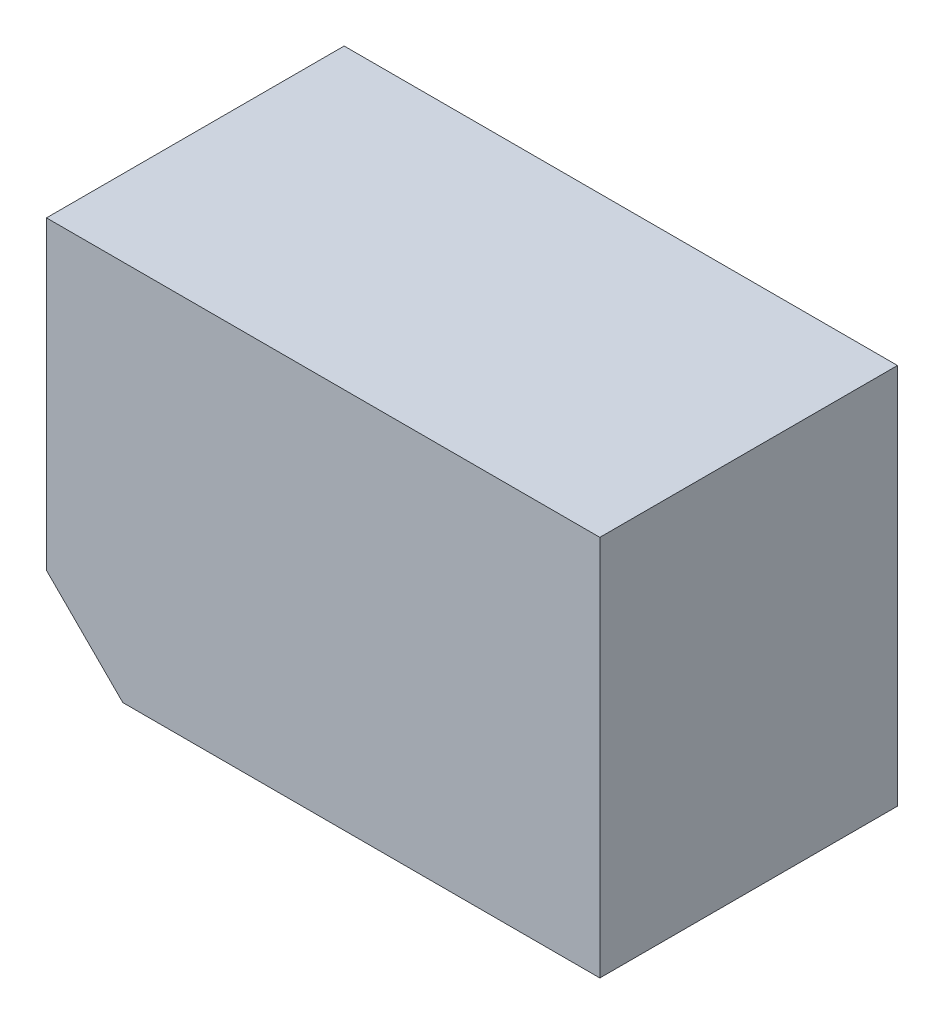
ISO-10303-21;
HEADER;
FILE_DESCRIPTION(('STEP AP214'),'2;1');
FILE_NAME('part.step','',(''),(''),'','','');
FILE_SCHEMA(('AUTOMOTIVE_DESIGN { 1 0 10303 214 1 1 1 1 }'));
ENDSEC;
DATA;
#1=APPLICATION_CONTEXT('core data for automotive mechanical design processes');
#2=APPLICATION_PROTOCOL_DEFINITION('international standard','automotive_design',2000,#1);
#3=PRODUCT_CONTEXT('',#1,'mechanical');
#4=PRODUCT('Part','Part','',(#3));
#5=PRODUCT_RELATED_PRODUCT_CATEGORY('part','',(#4));
#6=PRODUCT_DEFINITION_FORMATION('','',#4);
#7=PRODUCT_DEFINITION_CONTEXT('part definition',#1,'design');
#8=PRODUCT_DEFINITION('design','',#6,#7);
#9=PRODUCT_DEFINITION_SHAPE('','',#8);
#10=(LENGTH_UNIT() NAMED_UNIT(*) SI_UNIT(.MILLI.,.METRE.));
#11=(NAMED_UNIT(*) PLANE_ANGLE_UNIT() SI_UNIT($,.RADIAN.));
#12=(NAMED_UNIT(*) SI_UNIT($,.STERADIAN.) SOLID_ANGLE_UNIT());
#13=UNCERTAINTY_MEASURE_WITH_UNIT(LENGTH_MEASURE(1.E-05),#10,'distance_accuracy_value','');
#14=(GEOMETRIC_REPRESENTATION_CONTEXT(3) GLOBAL_UNCERTAINTY_ASSIGNED_CONTEXT((#13)) GLOBAL_UNIT_ASSIGNED_CONTEXT((#10,
#11,#12)) REPRESENTATION_CONTEXT('',''));
#15=CARTESIAN_POINT('',(0.,0.,0.));
#16=DIRECTION('',(0.,0.,1.));
#17=DIRECTION('',(1.,0.,0.));
#18=AXIS2_PLACEMENT_3D('',#15,#16,#17);
#19=CARTESIAN_POINT('',(0.,0.,78.));
#20=DIRECTION('',(-1.,0.,0.));
#21=DIRECTION('',(0.,0.,1.));
#22=AXIS2_PLACEMENT_3D('',#19,#20,#21);
#23=PLANE('',#22);
#24=DIRECTION('',(0.,1.,0.));
#25=VECTOR('',#24,1.);
#26=CARTESIAN_POINT('',(0.,0.,0.));
#27=LINE('',#26,#25);
#28=CARTESIAN_POINT('',(0.,-100.,0.));
#29=VERTEX_POINT('',#28);
#30=CARTESIAN_POINT('',(0.,0.,0.));
#31=VERTEX_POINT('',#30);
#32=EDGE_CURVE('E106',#29,#31,#27,.T.);
#33=ORIENTED_EDGE('',*,*,#32,.T.);
#34=DIRECTION('',(0.,0.,-1.));
#35=VECTOR('',#34,1.);
#36=CARTESIAN_POINT('',(0.,0.,78.));
#37=LINE('',#36,#35);
#38=CARTESIAN_POINT('',(0.,0.,78.));
#39=VERTEX_POINT('',#38);
#40=EDGE_CURVE('E11',#39,#31,#37,.T.);
#41=ORIENTED_EDGE('',*,*,#40,.F.);
#42=DIRECTION('',(0.,1.,0.));
#43=VECTOR('',#42,1.);
#44=CARTESIAN_POINT('',(0.,0.,78.));
#45=LINE('',#44,#43);
#46=CARTESIAN_POINT('',(0.,-100.,78.));
#47=VERTEX_POINT('',#46);
#48=EDGE_CURVE('E114',#47,#39,#45,.T.);
#49=ORIENTED_EDGE('',*,*,#48,.F.);
#50=DIRECTION('',(0.,0.,-1.));
#51=VECTOR('',#50,1.);
#52=CARTESIAN_POINT('',(0.,-100.,78.));
#53=LINE('',#52,#51);
#54=EDGE_CURVE('E102',#47,#29,#53,.T.);
#55=ORIENTED_EDGE('',*,*,#54,.T.);
#56=EDGE_LOOP('',(#33,#41,#49,#55));
#57=FACE_BOUND('',#56,.T.);
#58=ADVANCED_FACE('F32',(#57),#23,.F.);
#59=CARTESIAN_POINT('',(0.,0.,78.));
#60=DIRECTION('',(0.,-1.,0.));
#61=DIRECTION('',(1.,0.,0.));
#62=AXIS2_PLACEMENT_3D('',#59,#60,#61);
#63=PLANE('',#62);
#64=DIRECTION('',(-1.,0.,0.));
#65=VECTOR('',#64,1.);
#66=CARTESIAN_POINT('',(0.,0.,0.));
#67=LINE('',#66,#65);
#68=CARTESIAN_POINT('',(-145.,-1.38777878078145E-13,0.));
#69=VERTEX_POINT('',#68);
#70=EDGE_CURVE('E109',#31,#69,#67,.T.);
#71=ORIENTED_EDGE('',*,*,#70,.T.);
#72=DIRECTION('',(0.,0.,-1.));
#73=VECTOR('',#72,1.);
#74=CARTESIAN_POINT('',(-145.,-1.38777878078145E-13,78.));
#75=LINE('',#74,#73);
#76=CARTESIAN_POINT('',(-145.,-1.38777878078145E-13,78.));
#77=VERTEX_POINT('',#76);
#78=EDGE_CURVE('E40',#77,#69,#75,.T.);
#79=ORIENTED_EDGE('',*,*,#78,.F.);
#80=DIRECTION('',(-1.,0.,0.));
#81=VECTOR('',#80,1.);
#82=CARTESIAN_POINT('',(0.,0.,78.));
#83=LINE('',#82,#81);
#84=EDGE_CURVE('E82',#39,#77,#83,.T.);
#85=ORIENTED_EDGE('',*,*,#84,.F.);
#86=ORIENTED_EDGE('',*,*,#40,.T.);
#87=EDGE_LOOP('',(#71,#79,#85,#86));
#88=FACE_BOUND('',#87,.T.);
#89=ADVANCED_FACE('F133',(#88),#63,.F.);
#90=CARTESIAN_POINT('',(-145.,-1.38777878078145E-13,78.));
#91=DIRECTION('',(1.,0.,0.));
#92=DIRECTION('',(0.,0.,-1.));
#93=AXIS2_PLACEMENT_3D('',#90,#91,#92);
#94=PLANE('',#93);
#95=DIRECTION('',(0.,-1.,0.));
#96=VECTOR('',#95,1.);
#97=CARTESIAN_POINT('',(-145.,-1.38777878078145E-13,0.));
#98=LINE('',#97,#96);
#99=CARTESIAN_POINT('',(-145.,-80.,0.));
#100=VERTEX_POINT('',#99);
#101=EDGE_CURVE('E97',#69,#100,#98,.T.);
#102=ORIENTED_EDGE('',*,*,#101,.T.);
#103=DIRECTION('',(0.,0.,-1.));
#104=VECTOR('',#103,1.);
#105=CARTESIAN_POINT('',(-145.,-80.,78.));
#106=LINE('',#105,#104);
#107=CARTESIAN_POINT('',(-145.,-80.,78.));
#108=VERTEX_POINT('',#107);
#109=EDGE_CURVE('E94',#108,#100,#106,.T.);
#110=ORIENTED_EDGE('',*,*,#109,.F.);
#111=DIRECTION('',(0.,-1.,0.));
#112=VECTOR('',#111,1.);
#113=CARTESIAN_POINT('',(-145.,-1.38777878078145E-13,78.));
#114=LINE('',#113,#112);
#115=EDGE_CURVE('E86',#77,#108,#114,.T.);
#116=ORIENTED_EDGE('',*,*,#115,.F.);
#117=ORIENTED_EDGE('',*,*,#78,.T.);
#118=EDGE_LOOP('',(#102,#110,#116,#117));
#119=FACE_BOUND('',#118,.T.);
#120=ADVANCED_FACE('F95',(#119),#94,.F.);
#121=CARTESIAN_POINT('',(-125.,-100.,78.));
#122=DIRECTION('',(0.707106781186547,0.707106781186548,0.));
#123=DIRECTION('',(-0.707106781186548,0.707106781186547,0.));
#124=AXIS2_PLACEMENT_3D('',#121,#122,#123);
#125=PLANE('',#124);
#126=DIRECTION('',(0.707106781186548,-0.707106781186547,0.));
#127=VECTOR('',#126,1.);
#128=CARTESIAN_POINT('',(-125.,-100.,0.));
#129=LINE('',#128,#127);
#130=CARTESIAN_POINT('',(-125.,-100.,0.));
#131=VERTEX_POINT('',#130);
#132=EDGE_CURVE('E68',#100,#131,#129,.T.);
#133=ORIENTED_EDGE('',*,*,#132,.T.);
#134=DIRECTION('',(0.,0.,-1.));
#135=VECTOR('',#134,1.);
#136=CARTESIAN_POINT('',(-125.,-100.,78.));
#137=LINE('',#136,#135);
#138=CARTESIAN_POINT('',(-125.,-100.,78.));
#139=VERTEX_POINT('',#138);
#140=EDGE_CURVE('E98',#139,#131,#137,.T.);
#141=ORIENTED_EDGE('',*,*,#140,.F.);
#142=DIRECTION('',(0.707106781186548,-0.707106781186547,0.));
#143=VECTOR('',#142,1.);
#144=CARTESIAN_POINT('',(-125.,-100.,78.));
#145=LINE('',#144,#143);
#146=EDGE_CURVE('E90',#108,#139,#145,.T.);
#147=ORIENTED_EDGE('',*,*,#146,.F.);
#148=ORIENTED_EDGE('',*,*,#109,.T.);
#149=EDGE_LOOP('',(#133,#141,#147,#148));
#150=FACE_BOUND('',#149,.T.);
#151=ADVANCED_FACE('F100',(#150),#125,.F.);
#152=CARTESIAN_POINT('',(0.,-100.,78.));
#153=DIRECTION('',(0.,1.,0.));
#154=DIRECTION('',(-1.,0.,0.));
#155=AXIS2_PLACEMENT_3D('',#152,#153,#154);
#156=PLANE('',#155);
#157=DIRECTION('',(1.,0.,0.));
#158=VECTOR('',#157,1.);
#159=CARTESIAN_POINT('',(0.,-100.,0.));
#160=LINE('',#159,#158);
#161=EDGE_CURVE('E74',#131,#29,#160,.T.);
#162=ORIENTED_EDGE('',*,*,#161,.T.);
#163=ORIENTED_EDGE('',*,*,#54,.F.);
#164=DIRECTION('',(1.,0.,0.));
#165=VECTOR('',#164,1.);
#166=CARTESIAN_POINT('',(0.,-100.,78.));
#167=LINE('',#166,#165);
#168=EDGE_CURVE('E48',#139,#47,#167,.T.);
#169=ORIENTED_EDGE('',*,*,#168,.F.);
#170=ORIENTED_EDGE('',*,*,#140,.T.);
#171=EDGE_LOOP('',(#162,#163,#169,#170));
#172=FACE_BOUND('',#171,.T.);
#173=ADVANCED_FACE('F122',(#172),#156,.F.);
#174=CARTESIAN_POINT('',(0.,-100.,78.));
#175=DIRECTION('',(0.,0.,-1.));
#176=DIRECTION('',(-1.,0.,0.));
#177=AXIS2_PLACEMENT_3D('',#174,#175,#176);
#178=PLANE('',#177);
#179=ORIENTED_EDGE('',*,*,#48,.T.);
#180=ORIENTED_EDGE('',*,*,#84,.T.);
#181=ORIENTED_EDGE('',*,*,#115,.T.);
#182=ORIENTED_EDGE('',*,*,#146,.T.);
#183=ORIENTED_EDGE('',*,*,#168,.T.);
#184=EDGE_LOOP('',(#179,#180,#181,#182,#183));
#185=FACE_BOUND('',#184,.T.);
#186=ADVANCED_FACE('F88',(#185),#178,.F.);
#187=CARTESIAN_POINT('',(0.,-100.,0.));
#188=DIRECTION('',(0.,0.,-1.));
#189=DIRECTION('',(-1.,0.,0.));
#190=AXIS2_PLACEMENT_3D('',#187,#188,#189);
#191=PLANE('',#190);
#192=ORIENTED_EDGE('',*,*,#32,.F.);
#193=ORIENTED_EDGE('',*,*,#161,.F.);
#194=ORIENTED_EDGE('',*,*,#132,.F.);
#195=ORIENTED_EDGE('',*,*,#101,.F.);
#196=ORIENTED_EDGE('',*,*,#70,.F.);
#197=EDGE_LOOP('',(#192,#193,#194,#195,#196));
#198=FACE_BOUND('',#197,.T.);
#199=ADVANCED_FACE('F118',(#198),#191,.T.);
#200=CLOSED_SHELL('',(#58,#89,#120,#151,#173,#186,#199));
#201=MANIFOLD_SOLID_BREP('B2',#200);
#202=ADVANCED_BREP_SHAPE_REPRESENTATION('',(#18,#201),#14);
#203=SHAPE_DEFINITION_REPRESENTATION(#9,#202);
ENDSEC;
END-ISO-10303-21;
